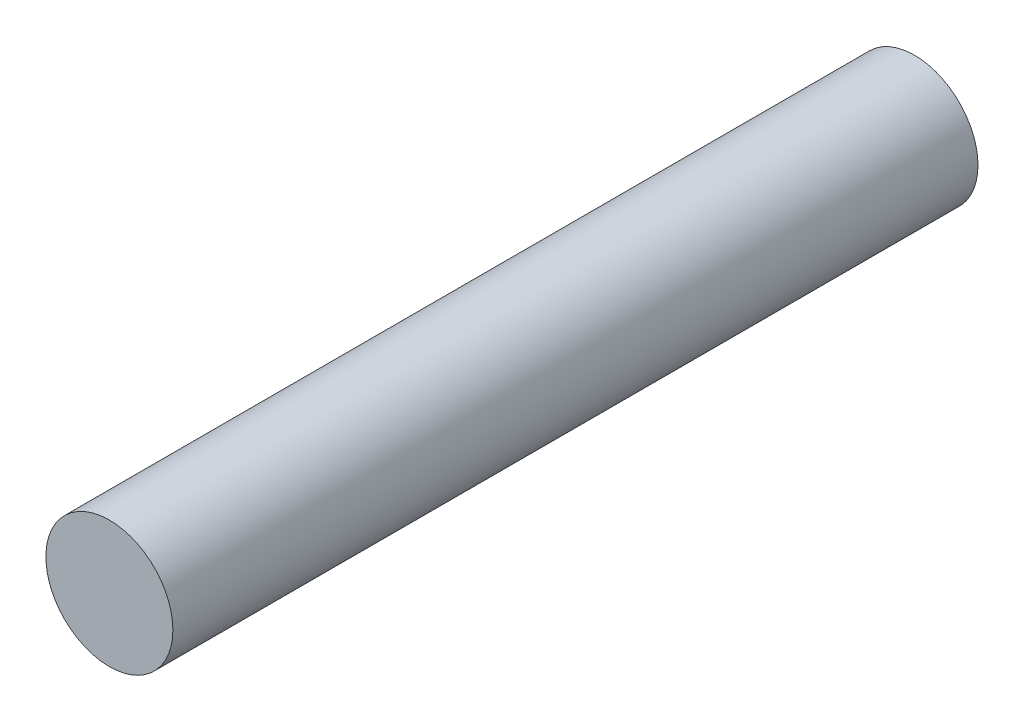
ISO-10303-21;
HEADER;
FILE_DESCRIPTION(('STEP AP214'),'2;1');
FILE_NAME('part.step','',(''),(''),'','','');
FILE_SCHEMA(('AUTOMOTIVE_DESIGN { 1 0 10303 214 1 1 1 1 }'));
ENDSEC;
DATA;
#1=APPLICATION_CONTEXT('core data for automotive mechanical design processes');
#2=APPLICATION_PROTOCOL_DEFINITION('international standard','automotive_design',2000,#1);
#3=PRODUCT_CONTEXT('',#1,'mechanical');
#4=PRODUCT('Part','Part','',(#3));
#5=PRODUCT_RELATED_PRODUCT_CATEGORY('part','',(#4));
#6=PRODUCT_DEFINITION_FORMATION('','',#4);
#7=PRODUCT_DEFINITION_CONTEXT('part definition',#1,'design');
#8=PRODUCT_DEFINITION('design','',#6,#7);
#9=PRODUCT_DEFINITION_SHAPE('','',#8);
#10=(LENGTH_UNIT() NAMED_UNIT(*) SI_UNIT(.MILLI.,.METRE.));
#11=(NAMED_UNIT(*) PLANE_ANGLE_UNIT() SI_UNIT($,.RADIAN.));
#12=(NAMED_UNIT(*) SI_UNIT($,.STERADIAN.) SOLID_ANGLE_UNIT());
#13=UNCERTAINTY_MEASURE_WITH_UNIT(LENGTH_MEASURE(1.E-05),#10,'distance_accuracy_value','');
#14=(GEOMETRIC_REPRESENTATION_CONTEXT(3) GLOBAL_UNCERTAINTY_ASSIGNED_CONTEXT((#13)) GLOBAL_UNIT_ASSIGNED_CONTEXT((#10,
#11,#12)) REPRESENTATION_CONTEXT('',''));
#15=CARTESIAN_POINT('',(0.,0.,0.));
#16=DIRECTION('',(0.,0.,1.));
#17=DIRECTION('',(1.,0.,0.));
#18=AXIS2_PLACEMENT_3D('',#15,#16,#17);
#19=CARTESIAN_POINT('',(0.,0.,31.7));
#20=DIRECTION('',(0.,0.,-1.));
#21=DIRECTION('',(-1.,0.,0.));
#22=AXIS2_PLACEMENT_3D('',#19,#20,#21);
#23=CYLINDRICAL_SURFACE('',#22,2.5);
#24=CARTESIAN_POINT('',(0.,0.,31.7));
#25=DIRECTION('',(0.,0.,1.));
#26=DIRECTION('',(1.,0.,0.));
#27=AXIS2_PLACEMENT_3D('',#24,#25,#26);
#28=CIRCLE('',#27,2.5);
#29=CARTESIAN_POINT('',(2.5,0.,31.7));
#30=VERTEX_POINT('',#29);
#31=EDGE_CURVE('E10',#30,#30,#28,.T.);
#32=ORIENTED_EDGE('',*,*,#31,.F.);
#33=EDGE_LOOP('',(#32));
#34=FACE_BOUND('',#33,.T.);
#35=CARTESIAN_POINT('',(0.,0.,0.));
#36=DIRECTION('',(0.,0.,1.));
#37=DIRECTION('',(1.,0.,0.));
#38=AXIS2_PLACEMENT_3D('',#35,#36,#37);
#39=CIRCLE('',#38,2.5);
#40=CARTESIAN_POINT('',(2.5,0.,0.));
#41=VERTEX_POINT('',#40);
#42=EDGE_CURVE('E34',#41,#41,#39,.T.);
#43=ORIENTED_EDGE('',*,*,#42,.T.);
#44=EDGE_LOOP('',(#43));
#45=FACE_BOUND('',#44,.T.);
#46=ADVANCED_FACE('F31',(#34,#45),#23,.T.);
#47=CARTESIAN_POINT('',(0.,0.,31.7));
#48=DIRECTION('',(0.,0.,1.));
#49=DIRECTION('',(1.,0.,0.));
#50=AXIS2_PLACEMENT_3D('',#47,#48,#49);
#51=PLANE('',#50);
#52=ORIENTED_EDGE('',*,*,#31,.T.);
#53=EDGE_LOOP('',(#52));
#54=FACE_BOUND('',#53,.T.);
#55=ADVANCED_FACE('F46',(#54),#51,.T.);
#56=CARTESIAN_POINT('',(0.,0.,0.));
#57=DIRECTION('',(0.,0.,1.));
#58=DIRECTION('',(1.,0.,0.));
#59=AXIS2_PLACEMENT_3D('',#56,#57,#58);
#60=PLANE('',#59);
#61=ORIENTED_EDGE('',*,*,#42,.F.);
#62=EDGE_LOOP('',(#61));
#63=FACE_BOUND('',#62,.T.);
#64=ADVANCED_FACE('F44',(#63),#60,.F.);
#65=CLOSED_SHELL('',(#46,#55,#64));
#66=MANIFOLD_SOLID_BREP('B2',#65);
#67=ADVANCED_BREP_SHAPE_REPRESENTATION('',(#18,#66),#14);
#68=SHAPE_DEFINITION_REPRESENTATION(#9,#67);
ENDSEC;
END-ISO-10303-21;
